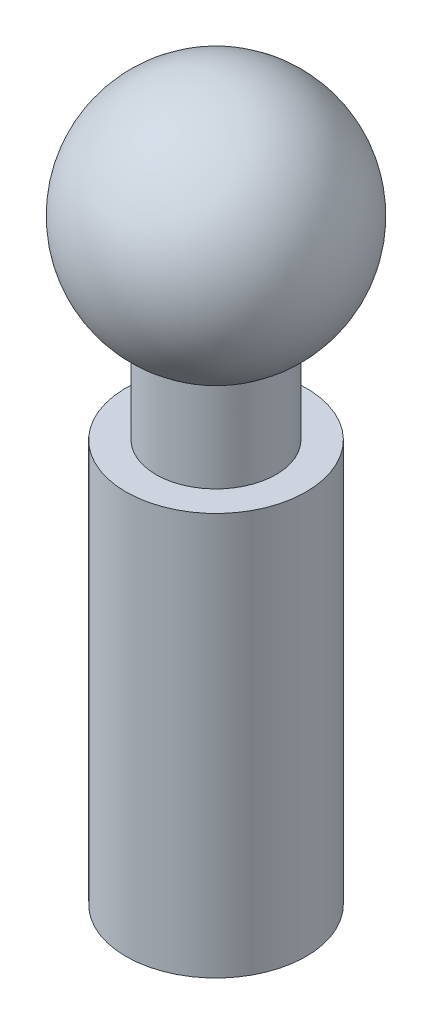
ISO-10303-21;
HEADER;
FILE_DESCRIPTION(('STEP AP214'),'2;1');
FILE_NAME('part.step','',(''),(''),'','','');
FILE_SCHEMA(('AUTOMOTIVE_DESIGN { 1 0 10303 214 1 1 1 1 }'));
ENDSEC;
DATA;
#1=APPLICATION_CONTEXT('core data for automotive mechanical design processes');
#2=APPLICATION_PROTOCOL_DEFINITION('international standard','automotive_design',2000,#1);
#3=PRODUCT_CONTEXT('',#1,'mechanical');
#4=PRODUCT('Part','Part','',(#3));
#5=PRODUCT_RELATED_PRODUCT_CATEGORY('part','',(#4));
#6=PRODUCT_DEFINITION_FORMATION('','',#4);
#7=PRODUCT_DEFINITION_CONTEXT('part definition',#1,'design');
#8=PRODUCT_DEFINITION('design','',#6,#7);
#9=PRODUCT_DEFINITION_SHAPE('','',#8);
#10=(LENGTH_UNIT() NAMED_UNIT(*) SI_UNIT(.MILLI.,.METRE.));
#11=(NAMED_UNIT(*) PLANE_ANGLE_UNIT() SI_UNIT($,.RADIAN.));
#12=(NAMED_UNIT(*) SI_UNIT($,.STERADIAN.) SOLID_ANGLE_UNIT());
#13=UNCERTAINTY_MEASURE_WITH_UNIT(LENGTH_MEASURE(1.E-05),#10,'distance_accuracy_value','');
#14=(GEOMETRIC_REPRESENTATION_CONTEXT(3) GLOBAL_UNCERTAINTY_ASSIGNED_CONTEXT((#13)) GLOBAL_UNIT_ASSIGNED_CONTEXT((#10,
#11,#12)) REPRESENTATION_CONTEXT('',''));
#15=CARTESIAN_POINT('',(0.,0.,0.));
#16=DIRECTION('',(0.,0.,1.));
#17=DIRECTION('',(1.,0.,0.));
#18=AXIS2_PLACEMENT_3D('',#15,#16,#17);
#19=CARTESIAN_POINT('',(0.,42.545,0.));
#20=DIRECTION('',(0.,-1.,0.));
#21=DIRECTION('',(0.,0.,-1.));
#22=AXIS2_PLACEMENT_3D('',#19,#20,#21);
#23=CYLINDRICAL_SURFACE('',#22,9.525);
#24=CARTESIAN_POINT('',(0.,42.545,0.));
#25=DIRECTION('',(0.,1.,0.));
#26=DIRECTION('',(0.,0.,1.));
#27=AXIS2_PLACEMENT_3D('',#24,#25,#26);
#28=CIRCLE('',#27,9.525);
#29=CARTESIAN_POINT('',(0.,42.545,9.525));
#30=VERTEX_POINT('',#29);
#31=EDGE_CURVE('E37',#30,#30,#28,.T.);
#32=ORIENTED_EDGE('',*,*,#31,.F.);
#33=EDGE_LOOP('',(#32));
#34=FACE_BOUND('',#33,.T.);
#35=CARTESIAN_POINT('',(0.,0.,0.));
#36=DIRECTION('',(0.,1.,0.));
#37=DIRECTION('',(0.,0.,1.));
#38=AXIS2_PLACEMENT_3D('',#35,#36,#37);
#39=CIRCLE('',#38,9.525);
#40=CARTESIAN_POINT('',(0.,0.,9.525));
#41=VERTEX_POINT('',#40);
#42=EDGE_CURVE('E41',#41,#41,#39,.T.);
#43=ORIENTED_EDGE('',*,*,#42,.T.);
#44=EDGE_LOOP('',(#43));
#45=FACE_BOUND('',#44,.T.);
#46=ADVANCED_FACE('F31',(#34,#45),#23,.T.);
#47=CARTESIAN_POINT('',(0.,42.545,0.));
#48=DIRECTION('',(0.,1.,0.));
#49=DIRECTION('',(0.,0.,1.));
#50=AXIS2_PLACEMENT_3D('',#47,#48,#49);
#51=PLANE('',#50);
#52=CARTESIAN_POINT('',(0.,42.545,0.));
#53=DIRECTION('',(0.,1.,0.));
#54=DIRECTION('',(0.,0.,1.));
#55=AXIS2_PLACEMENT_3D('',#52,#53,#54);
#56=CIRCLE('',#55,6.35);
#57=CARTESIAN_POINT('',(0.,42.545,6.35));
#58=VERTEX_POINT('',#57);
#59=EDGE_CURVE('E10',#58,#58,#56,.T.);
#60=ORIENTED_EDGE('',*,*,#59,.F.);
#61=EDGE_LOOP('',(#60));
#62=FACE_BOUND('',#61,.T.);
#63=ORIENTED_EDGE('',*,*,#31,.T.);
#64=EDGE_LOOP('',(#63));
#65=FACE_BOUND('',#64,.T.);
#66=ADVANCED_FACE('F62',(#62,#65),#51,.T.);
#67=CARTESIAN_POINT('',(0.,0.,0.));
#68=DIRECTION('',(0.,1.,0.));
#69=DIRECTION('',(0.,0.,1.));
#70=AXIS2_PLACEMENT_3D('',#67,#68,#69);
#71=PLANE('',#70);
#72=ORIENTED_EDGE('',*,*,#42,.F.);
#73=EDGE_LOOP('',(#72));
#74=FACE_BOUND('',#73,.T.);
#75=ADVANCED_FACE('F59',(#74),#71,.F.);
#76=CARTESIAN_POINT('',(0.,63.0685226280624,0.));
#77=DIRECTION('',(0.,1.,0.));
#78=DIRECTION('',(0.,0.,-1.));
#79=AXIS2_PLACEMENT_3D('',#76,#77,#78);
#80=SPHERICAL_SURFACE('',#79,12.7);
#81=CARTESIAN_POINT('',(0.,52.07,0.));
#82=DIRECTION('',(0.,1.,0.));
#83=DIRECTION('',(0.,0.,1.));
#84=AXIS2_PLACEMENT_3D('',#81,#82,#83);
#85=CIRCLE('',#84,6.35);
#86=CARTESIAN_POINT('',(0.,52.07,6.35));
#87=VERTEX_POINT('',#86);
#88=EDGE_CURVE('E46',#87,#87,#85,.T.);
#89=ORIENTED_EDGE('',*,*,#88,.T.);
#90=EDGE_LOOP('',(#89));
#91=FACE_BOUND('',#90,.T.);
#92=ADVANCED_FACE('F51',(#91),#80,.T.);
#93=CARTESIAN_POINT('',(0.,75.7685226280624,0.));
#94=DIRECTION('',(0.,1.,0.));
#95=DIRECTION('',(0.,0.,1.));
#96=AXIS2_PLACEMENT_3D('',#93,#94,#95);
#97=CYLINDRICAL_SURFACE('',#96,6.35);
#98=ORIENTED_EDGE('',*,*,#59,.T.);
#99=EDGE_LOOP('',(#98));
#100=FACE_BOUND('',#99,.T.);
#101=ORIENTED_EDGE('',*,*,#88,.F.);
#102=EDGE_LOOP('',(#101));
#103=FACE_BOUND('',#102,.T.);
#104=ADVANCED_FACE('F53',(#100,#103),#97,.T.);
#105=CLOSED_SHELL('',(#46,#66,#75,#92,#104));
#106=MANIFOLD_SOLID_BREP('B2',#105);
#107=ADVANCED_BREP_SHAPE_REPRESENTATION('',(#18,#106),#14);
#108=SHAPE_DEFINITION_REPRESENTATION(#9,#107);
ENDSEC;
END-ISO-10303-21;
